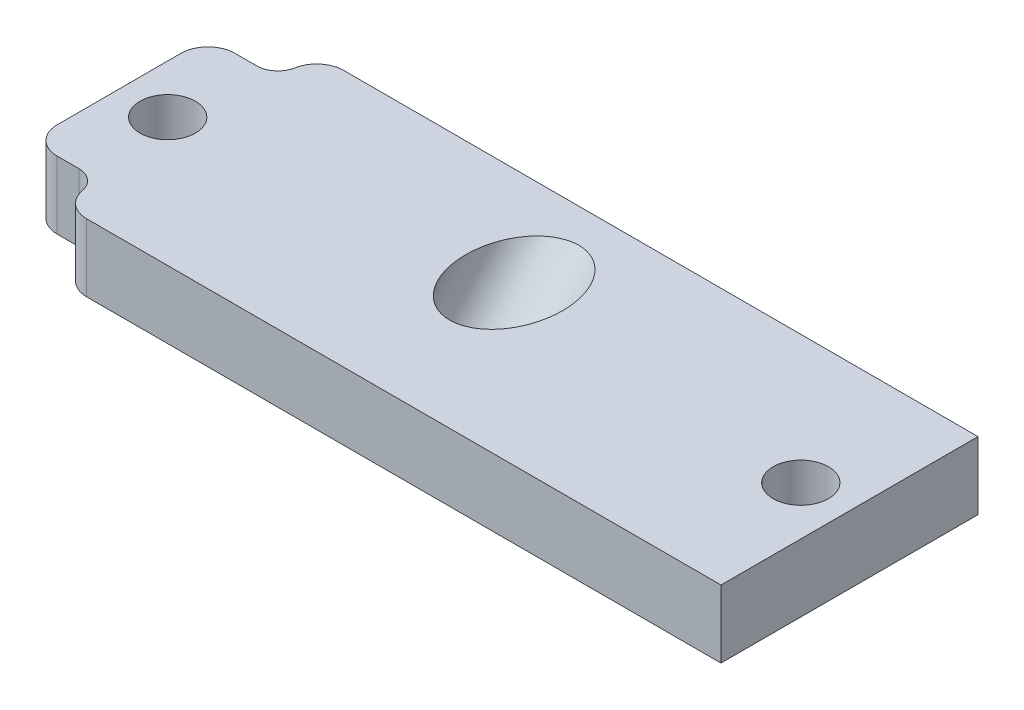
ISO-10303-21;
HEADER;
FILE_DESCRIPTION(('STEP AP214'),'2;1');
FILE_NAME('part.step','',(''),(''),'','','');
FILE_SCHEMA(('AUTOMOTIVE_DESIGN { 1 0 10303 214 1 1 1 1 }'));
ENDSEC;
DATA;
#1=APPLICATION_CONTEXT('core data for automotive mechanical design processes');
#2=APPLICATION_PROTOCOL_DEFINITION('international standard','automotive_design',2000,#1);
#3=PRODUCT_CONTEXT('',#1,'mechanical');
#4=PRODUCT('Part','Part','',(#3));
#5=PRODUCT_RELATED_PRODUCT_CATEGORY('part','',(#4));
#6=PRODUCT_DEFINITION_FORMATION('','',#4);
#7=PRODUCT_DEFINITION_CONTEXT('part definition',#1,'design');
#8=PRODUCT_DEFINITION('design','',#6,#7);
#9=PRODUCT_DEFINITION_SHAPE('','',#8);
#10=(LENGTH_UNIT() NAMED_UNIT(*) SI_UNIT(.MILLI.,.METRE.));
#11=(NAMED_UNIT(*) PLANE_ANGLE_UNIT() SI_UNIT($,.RADIAN.));
#12=(NAMED_UNIT(*) SI_UNIT($,.STERADIAN.) SOLID_ANGLE_UNIT());
#13=UNCERTAINTY_MEASURE_WITH_UNIT(LENGTH_MEASURE(1.E-05),#10,'distance_accuracy_value','');
#14=(GEOMETRIC_REPRESENTATION_CONTEXT(3) GLOBAL_UNCERTAINTY_ASSIGNED_CONTEXT((#13)) GLOBAL_UNIT_ASSIGNED_CONTEXT((#10,
#11,#12)) REPRESENTATION_CONTEXT('',''));
#15=CARTESIAN_POINT('',(0.,0.,0.));
#16=DIRECTION('',(0.,0.,1.));
#17=DIRECTION('',(1.,0.,0.));
#18=AXIS2_PLACEMENT_3D('',#15,#16,#17);
#19=CARTESIAN_POINT('',(0.,6.35,0.));
#20=DIRECTION('',(0.,-1.,0.));
#21=DIRECTION('',(0.,0.,-1.));
#22=AXIS2_PLACEMENT_3D('',#19,#20,#21);
#23=PLANE('',#22);
#24=CARTESIAN_POINT('',(34.29,6.35,-14.8740027149651));
#25=DIRECTION('',(0.,-1.,0.));
#26=DIRECTION('',(0.,0.,1.));
#27=AXIS2_PLACEMENT_3D('',#24,#25,#26);
#28=ELLIPSE('',#27,6.07512550302269,4.55);
#29=CARTESIAN_POINT('',(34.29,6.35,-8.79887721194244));
#30=VERTEX_POINT('',#29);
#31=EDGE_CURVE('E421',#30,#30,#28,.F.);
#32=ORIENTED_EDGE('',*,*,#31,.F.);
#33=EDGE_LOOP('',(#32));
#34=FACE_BOUND('',#33,.T.);
#35=CARTESIAN_POINT('',(4.57,6.35,-12.065));
#36=DIRECTION('',(0.,1.,0.));
#37=DIRECTION('',(0.,0.,1.));
#38=AXIS2_PLACEMENT_3D('',#35,#36,#37);
#39=CIRCLE('',#38,2.6);
#40=CARTESIAN_POINT('',(4.57,6.35,-9.465));
#41=VERTEX_POINT('',#40);
#42=EDGE_CURVE('E174',#41,#41,#39,.T.);
#43=ORIENTED_EDGE('',*,*,#42,.F.);
#44=EDGE_LOOP('',(#43));
#45=FACE_BOUND('',#44,.T.);
#46=CARTESIAN_POINT('',(64.01,6.35,-12.065));
#47=DIRECTION('',(0.,1.,0.));
#48=DIRECTION('',(0.,0.,1.));
#49=AXIS2_PLACEMENT_3D('',#46,#47,#48);
#50=CIRCLE('',#49,2.59999999999999);
#51=CARTESIAN_POINT('',(64.01,6.35,-9.46500000000001));
#52=VERTEX_POINT('',#51);
#53=EDGE_CURVE('E168',#52,#52,#50,.T.);
#54=ORIENTED_EDGE('',*,*,#53,.F.);
#55=EDGE_LOOP('',(#54));
#56=FACE_BOUND('',#55,.T.);
#57=CARTESIAN_POINT('',(4.57,6.35,-1.715));
#58=DIRECTION('',(0.,1.,0.));
#59=DIRECTION('',(0.,0.,1.));
#60=AXIS2_PLACEMENT_3D('',#57,#58,#59);
#61=CIRCLE('',#60,2.);
#62=CARTESIAN_POINT('',(4.57,6.35,-3.715));
#63=VERTEX_POINT('',#62);
#64=CARTESIAN_POINT('',(6.53670134597141,6.35,-2.07843612334802));
#65=VERTEX_POINT('',#64);
#66=EDGE_CURVE('E137',#63,#65,#61,.F.);
#67=ORIENTED_EDGE('',*,*,#66,.T.);
#68=CARTESIAN_POINT('',(9.03441205535511,6.35,-2.54));
#69=DIRECTION('',(0.,-1.,0.));
#70=DIRECTION('',(0.,0.,-1.));
#71=AXIS2_PLACEMENT_3D('',#68,#69,#70);
#72=CIRCLE('',#71,2.54);
#73=CARTESIAN_POINT('',(9.03441205535511,6.35,0.));
#74=VERTEX_POINT('',#73);
#75=EDGE_CURVE('E213',#65,#74,#72,.F.);
#76=ORIENTED_EDGE('',*,*,#75,.T.);
#77=DIRECTION('',(1.,0.,0.));
#78=VECTOR('',#77,1.);
#79=CARTESIAN_POINT('',(0.,6.35,0.));
#80=LINE('',#79,#78);
#81=CARTESIAN_POINT('',(68.58,6.35,0.));
#82=VERTEX_POINT('',#81);
#83=EDGE_CURVE('E183',#74,#82,#80,.T.);
#84=ORIENTED_EDGE('',*,*,#83,.T.);
#85=DIRECTION('',(0.,0.,-1.));
#86=VECTOR('',#85,1.);
#87=CARTESIAN_POINT('',(68.58,6.35,0.));
#88=LINE('',#87,#86);
#89=CARTESIAN_POINT('',(68.58,6.35,-24.13));
#90=VERTEX_POINT('',#89);
#91=EDGE_CURVE('E186',#82,#90,#88,.T.);
#92=ORIENTED_EDGE('',*,*,#91,.T.);
#93=DIRECTION('',(-1.,0.,0.));
#94=VECTOR('',#93,1.);
#95=CARTESIAN_POINT('',(0.,6.35,-24.13));
#96=LINE('',#95,#94);
#97=CARTESIAN_POINT('',(9.03441205535511,6.35,-24.13));
#98=VERTEX_POINT('',#97);
#99=EDGE_CURVE('E188',#90,#98,#96,.T.);
#100=ORIENTED_EDGE('',*,*,#99,.T.);
#101=CARTESIAN_POINT('',(9.03441205535511,6.35,-21.59));
#102=DIRECTION('',(0.,-1.,0.));
#103=DIRECTION('',(0.,0.,-1.));
#104=AXIS2_PLACEMENT_3D('',#101,#102,#103);
#105=CIRCLE('',#104,2.54);
#106=CARTESIAN_POINT('',(6.53670134597141,6.35,-22.051563876652));
#107=VERTEX_POINT('',#106);
#108=EDGE_CURVE('E207',#98,#107,#105,.F.);
#109=ORIENTED_EDGE('',*,*,#108,.T.);
#110=CARTESIAN_POINT('',(4.57,6.35,-22.415));
#111=DIRECTION('',(0.,1.,0.));
#112=DIRECTION('',(0.,0.,1.));
#113=AXIS2_PLACEMENT_3D('',#110,#111,#112);
#114=CIRCLE('',#113,2.);
#115=CARTESIAN_POINT('',(4.57,6.35,-20.415));
#116=VERTEX_POINT('',#115);
#117=EDGE_CURVE('E148',#116,#107,#114,.T.);
#118=ORIENTED_EDGE('',*,*,#117,.F.);
#119=DIRECTION('',(-1.,0.,0.));
#120=VECTOR('',#119,1.);
#121=CARTESIAN_POINT('',(0.,6.35,-20.415));
#122=LINE('',#121,#120);
#123=CARTESIAN_POINT('',(2.54,6.35,-20.415));
#124=VERTEX_POINT('',#123);
#125=EDGE_CURVE('E133',#116,#124,#122,.T.);
#126=ORIENTED_EDGE('',*,*,#125,.T.);
#127=CARTESIAN_POINT('',(2.54,6.35,-17.875));
#128=DIRECTION('',(0.,-1.,0.));
#129=DIRECTION('',(0.,0.,-1.));
#130=AXIS2_PLACEMENT_3D('',#127,#128,#129);
#131=CIRCLE('',#130,2.54);
#132=CARTESIAN_POINT('',(0.,6.35,-17.875));
#133=VERTEX_POINT('',#132);
#134=EDGE_CURVE('E209',#124,#133,#131,.F.);
#135=ORIENTED_EDGE('',*,*,#134,.T.);
#136=DIRECTION('',(0.,0.,1.));
#137=VECTOR('',#136,1.);
#138=CARTESIAN_POINT('',(0.,6.35,0.));
#139=LINE('',#138,#137);
#140=CARTESIAN_POINT('',(0.,6.35,-6.255));
#141=VERTEX_POINT('',#140);
#142=EDGE_CURVE('E180',#133,#141,#139,.T.);
#143=ORIENTED_EDGE('',*,*,#142,.T.);
#144=CARTESIAN_POINT('',(2.54,6.35,-6.255));
#145=DIRECTION('',(0.,-1.,0.));
#146=DIRECTION('',(0.,0.,-1.));
#147=AXIS2_PLACEMENT_3D('',#144,#145,#146);
#148=CIRCLE('',#147,2.54);
#149=CARTESIAN_POINT('',(2.54,6.35,-3.715));
#150=VERTEX_POINT('',#149);
#151=EDGE_CURVE('E211',#141,#150,#148,.F.);
#152=ORIENTED_EDGE('',*,*,#151,.T.);
#153=DIRECTION('',(-1.,0.,0.));
#154=VECTOR('',#153,1.);
#155=CARTESIAN_POINT('',(0.,6.35,-3.715));
#156=LINE('',#155,#154);
#157=EDGE_CURVE('E160',#63,#150,#156,.T.);
#158=ORIENTED_EDGE('',*,*,#157,.F.);
#159=EDGE_LOOP('',(#67,#76,#84,#92,#100,#109,#118,#126,#135,#143,#152,#158));
#160=FACE_BOUND('',#159,.T.);
#161=ADVANCED_FACE('F33',(#34,#45,#56,#160),#23,.F.);
#162=CARTESIAN_POINT('',(0.,0.,0.));
#163=DIRECTION('',(0.,-1.,0.));
#164=DIRECTION('',(0.,0.,-1.));
#165=AXIS2_PLACEMENT_3D('',#162,#163,#164);
#166=PLANE('',#165);
#167=CARTESIAN_POINT('',(34.29,0.,-9.25599728503487));
#168=DIRECTION('',(0.,-1.,0.));
#169=DIRECTION('',(0.,0.,-1.));
#170=AXIS2_PLACEMENT_3D('',#167,#168,#169);
#171=ELLIPSE('',#170,6.07512550302269,4.55);
#172=CARTESIAN_POINT('',(34.29,0.,-15.3311227880576));
#173=VERTEX_POINT('',#172);
#174=EDGE_CURVE('E152',#173,#173,#171,.T.);
#175=ORIENTED_EDGE('',*,*,#174,.F.);
#176=EDGE_LOOP('',(#175));
#177=FACE_BOUND('',#176,.T.);
#178=CARTESIAN_POINT('',(4.57,0.,-12.065));
#179=DIRECTION('',(0.,1.,0.));
#180=DIRECTION('',(0.,0.,1.));
#181=AXIS2_PLACEMENT_3D('',#178,#179,#180);
#182=CIRCLE('',#181,2.6);
#183=CARTESIAN_POINT('',(4.57,0.,-9.465));
#184=VERTEX_POINT('',#183);
#185=EDGE_CURVE('E171',#184,#184,#182,.T.);
#186=ORIENTED_EDGE('',*,*,#185,.T.);
#187=EDGE_LOOP('',(#186));
#188=FACE_BOUND('',#187,.T.);
#189=CARTESIAN_POINT('',(64.01,0.,-12.065));
#190=DIRECTION('',(0.,1.,0.));
#191=DIRECTION('',(0.,0.,1.));
#192=AXIS2_PLACEMENT_3D('',#189,#190,#191);
#193=CIRCLE('',#192,2.59999999999999);
#194=CARTESIAN_POINT('',(64.01,0.,-9.46500000000001));
#195=VERTEX_POINT('',#194);
#196=EDGE_CURVE('E167',#195,#195,#193,.T.);
#197=ORIENTED_EDGE('',*,*,#196,.T.);
#198=EDGE_LOOP('',(#197));
#199=FACE_BOUND('',#198,.T.);
#200=DIRECTION('',(1.,0.,0.));
#201=VECTOR('',#200,1.);
#202=CARTESIAN_POINT('',(0.,0.,0.));
#203=LINE('',#202,#201);
#204=CARTESIAN_POINT('',(9.03441205535511,0.,0.));
#205=VERTEX_POINT('',#204);
#206=CARTESIAN_POINT('',(68.58,0.,0.));
#207=VERTEX_POINT('',#206);
#208=EDGE_CURVE('E194',#205,#207,#203,.T.);
#209=ORIENTED_EDGE('',*,*,#208,.F.);
#210=CARTESIAN_POINT('',(9.03441205535511,0.,-2.54));
#211=DIRECTION('',(0.,-1.,0.));
#212=DIRECTION('',(0.,0.,-1.));
#213=AXIS2_PLACEMENT_3D('',#210,#211,#212);
#214=CIRCLE('',#213,2.54);
#215=CARTESIAN_POINT('',(6.53670134597141,0.,-2.07843612334802));
#216=VERTEX_POINT('',#215);
#217=EDGE_CURVE('E221',#205,#216,#214,.T.);
#218=ORIENTED_EDGE('',*,*,#217,.T.);
#219=CARTESIAN_POINT('',(4.57,0.,-1.715));
#220=DIRECTION('',(0.,1.,0.));
#221=DIRECTION('',(0.,0.,1.));
#222=AXIS2_PLACEMENT_3D('',#219,#220,#221);
#223=CIRCLE('',#222,2.);
#224=CARTESIAN_POINT('',(4.57,0.,-3.715));
#225=VERTEX_POINT('',#224);
#226=EDGE_CURVE('E156',#225,#216,#223,.F.);
#227=ORIENTED_EDGE('',*,*,#226,.F.);
#228=DIRECTION('',(-1.,0.,0.));
#229=VECTOR('',#228,1.);
#230=CARTESIAN_POINT('',(0.,0.,-3.715));
#231=LINE('',#230,#229);
#232=CARTESIAN_POINT('',(2.54,0.,-3.715));
#233=VERTEX_POINT('',#232);
#234=EDGE_CURVE('E159',#225,#233,#231,.T.);
#235=ORIENTED_EDGE('',*,*,#234,.T.);
#236=CARTESIAN_POINT('',(2.54,0.,-6.255));
#237=DIRECTION('',(0.,-1.,0.));
#238=DIRECTION('',(0.,0.,-1.));
#239=AXIS2_PLACEMENT_3D('',#236,#237,#238);
#240=CIRCLE('',#239,2.54);
#241=CARTESIAN_POINT('',(0.,0.,-6.255));
#242=VERTEX_POINT('',#241);
#243=EDGE_CURVE('E219',#233,#242,#240,.T.);
#244=ORIENTED_EDGE('',*,*,#243,.T.);
#245=DIRECTION('',(0.,0.,1.));
#246=VECTOR('',#245,1.);
#247=CARTESIAN_POINT('',(0.,0.,0.));
#248=LINE('',#247,#246);
#249=CARTESIAN_POINT('',(0.,0.,-17.875));
#250=VERTEX_POINT('',#249);
#251=EDGE_CURVE('E177',#250,#242,#248,.T.);
#252=ORIENTED_EDGE('',*,*,#251,.F.);
#253=CARTESIAN_POINT('',(2.54,0.,-17.875));
#254=DIRECTION('',(0.,-1.,0.));
#255=DIRECTION('',(0.,0.,-1.));
#256=AXIS2_PLACEMENT_3D('',#253,#254,#255);
#257=CIRCLE('',#256,2.54);
#258=CARTESIAN_POINT('',(2.54,0.,-20.415));
#259=VERTEX_POINT('',#258);
#260=EDGE_CURVE('E147',#250,#259,#257,.T.);
#261=ORIENTED_EDGE('',*,*,#260,.T.);
#262=DIRECTION('',(-1.,0.,0.));
#263=VECTOR('',#262,1.);
#264=CARTESIAN_POINT('',(0.,0.,-20.415));
#265=LINE('',#264,#263);
#266=CARTESIAN_POINT('',(4.57,0.,-20.415));
#267=VERTEX_POINT('',#266);
#268=EDGE_CURVE('E130',#267,#259,#265,.T.);
#269=ORIENTED_EDGE('',*,*,#268,.F.);
#270=CARTESIAN_POINT('',(4.57,0.,-22.415));
#271=DIRECTION('',(0.,1.,0.));
#272=DIRECTION('',(0.,0.,1.));
#273=AXIS2_PLACEMENT_3D('',#270,#271,#272);
#274=CIRCLE('',#273,2.);
#275=CARTESIAN_POINT('',(6.53670134597141,0.,-22.051563876652));
#276=VERTEX_POINT('',#275);
#277=EDGE_CURVE('E138',#267,#276,#274,.T.);
#278=ORIENTED_EDGE('',*,*,#277,.T.);
#279=CARTESIAN_POINT('',(9.03441205535511,0.,-21.59));
#280=DIRECTION('',(0.,-1.,0.));
#281=DIRECTION('',(0.,0.,-1.));
#282=AXIS2_PLACEMENT_3D('',#279,#280,#281);
#283=CIRCLE('',#282,2.54);
#284=CARTESIAN_POINT('',(9.03441205535511,0.,-24.13));
#285=VERTEX_POINT('',#284);
#286=EDGE_CURVE('E56',#276,#285,#283,.T.);
#287=ORIENTED_EDGE('',*,*,#286,.T.);
#288=DIRECTION('',(-1.,0.,0.));
#289=VECTOR('',#288,1.);
#290=CARTESIAN_POINT('',(0.,0.,-24.13));
#291=LINE('',#290,#289);
#292=CARTESIAN_POINT('',(68.58,0.,-24.13));
#293=VERTEX_POINT('',#292);
#294=EDGE_CURVE('E184',#293,#285,#291,.T.);
#295=ORIENTED_EDGE('',*,*,#294,.F.);
#296=DIRECTION('',(0.,0.,-1.));
#297=VECTOR('',#296,1.);
#298=CARTESIAN_POINT('',(68.58,0.,0.));
#299=LINE('',#298,#297);
#300=EDGE_CURVE('E196',#207,#293,#299,.T.);
#301=ORIENTED_EDGE('',*,*,#300,.F.);
#302=EDGE_LOOP('',(#209,#218,#227,#235,#244,#252,#261,#269,#278,#287,#295,#301));
#303=FACE_BOUND('',#302,.T.);
#304=ADVANCED_FACE('F144',(#177,#188,#199,#303),#166,.T.);
#305=CARTESIAN_POINT('',(0.,6.35,0.));
#306=DIRECTION('',(1.,0.,0.));
#307=DIRECTION('',(0.,0.,-1.));
#308=AXIS2_PLACEMENT_3D('',#305,#306,#307);
#309=PLANE('',#308);
#310=ORIENTED_EDGE('',*,*,#251,.T.);
#311=DIRECTION('',(0.,1.,0.));
#312=VECTOR('',#311,1.);
#313=CARTESIAN_POINT('',(0.,6.35,-6.255));
#314=LINE('',#313,#312);
#315=EDGE_CURVE('E225',#242,#141,#314,.T.);
#316=ORIENTED_EDGE('',*,*,#315,.T.);
#317=ORIENTED_EDGE('',*,*,#142,.F.);
#318=DIRECTION('',(0.,1.,0.));
#319=VECTOR('',#318,1.);
#320=CARTESIAN_POINT('',(0.,0.,-17.875));
#321=LINE('',#320,#319);
#322=EDGE_CURVE('E223',#133,#250,#321,.F.);
#323=ORIENTED_EDGE('',*,*,#322,.T.);
#324=EDGE_LOOP('',(#310,#316,#317,#323));
#325=FACE_BOUND('',#324,.T.);
#326=ADVANCED_FACE('F261',(#325),#309,.F.);
#327=CARTESIAN_POINT('',(0.,6.35,0.));
#328=DIRECTION('',(0.,0.,-1.));
#329=DIRECTION('',(-1.,0.,0.));
#330=AXIS2_PLACEMENT_3D('',#327,#328,#329);
#331=PLANE('',#330);
#332=ORIENTED_EDGE('',*,*,#83,.F.);
#333=DIRECTION('',(0.,-1.,0.));
#334=VECTOR('',#333,1.);
#335=CARTESIAN_POINT('',(9.03441205535511,0.,0.));
#336=LINE('',#335,#334);
#337=EDGE_CURVE('E215',#74,#205,#336,.T.);
#338=ORIENTED_EDGE('',*,*,#337,.T.);
#339=ORIENTED_EDGE('',*,*,#208,.T.);
#340=DIRECTION('',(0.,-1.,0.));
#341=VECTOR('',#340,1.);
#342=CARTESIAN_POINT('',(68.58,6.35,0.));
#343=LINE('',#342,#341);
#344=EDGE_CURVE('E201',#82,#207,#343,.T.);
#345=ORIENTED_EDGE('',*,*,#344,.F.);
#346=EDGE_LOOP('',(#332,#338,#339,#345));
#347=FACE_BOUND('',#346,.T.);
#348=ADVANCED_FACE('F292',(#347),#331,.F.);
#349=CARTESIAN_POINT('',(68.58,6.35,0.));
#350=DIRECTION('',(-1.,0.,0.));
#351=DIRECTION('',(0.,0.,1.));
#352=AXIS2_PLACEMENT_3D('',#349,#350,#351);
#353=PLANE('',#352);
#354=ORIENTED_EDGE('',*,*,#300,.T.);
#355=DIRECTION('',(0.,-1.,0.));
#356=VECTOR('',#355,1.);
#357=CARTESIAN_POINT('',(68.58,6.35,-24.13));
#358=LINE('',#357,#356);
#359=EDGE_CURVE('E191',#90,#293,#358,.T.);
#360=ORIENTED_EDGE('',*,*,#359,.F.);
#361=ORIENTED_EDGE('',*,*,#91,.F.);
#362=ORIENTED_EDGE('',*,*,#344,.T.);
#363=EDGE_LOOP('',(#354,#360,#361,#362));
#364=FACE_BOUND('',#363,.T.);
#365=ADVANCED_FACE('F242',(#364),#353,.F.);
#366=CARTESIAN_POINT('',(0.,6.35,-24.13));
#367=DIRECTION('',(0.,0.,1.));
#368=DIRECTION('',(1.,0.,0.));
#369=AXIS2_PLACEMENT_3D('',#366,#367,#368);
#370=PLANE('',#369);
#371=ORIENTED_EDGE('',*,*,#294,.T.);
#372=DIRECTION('',(0.,1.,0.));
#373=VECTOR('',#372,1.);
#374=CARTESIAN_POINT('',(9.03441205535511,6.35,-24.13));
#375=LINE('',#374,#373);
#376=EDGE_CURVE('E41',#285,#98,#375,.T.);
#377=ORIENTED_EDGE('',*,*,#376,.T.);
#378=ORIENTED_EDGE('',*,*,#99,.F.);
#379=ORIENTED_EDGE('',*,*,#359,.T.);
#380=EDGE_LOOP('',(#371,#377,#378,#379));
#381=FACE_BOUND('',#380,.T.);
#382=ADVANCED_FACE('F234',(#381),#370,.F.);
#383=CARTESIAN_POINT('',(4.57,6.35,-12.065));
#384=DIRECTION('',(0.,-1.,0.));
#385=DIRECTION('',(0.,0.,-1.));
#386=AXIS2_PLACEMENT_3D('',#383,#384,#385);
#387=CYLINDRICAL_SURFACE('',#386,2.6);
#388=ORIENTED_EDGE('',*,*,#42,.T.);
#389=EDGE_LOOP('',(#388));
#390=FACE_BOUND('',#389,.T.);
#391=ORIENTED_EDGE('',*,*,#185,.F.);
#392=EDGE_LOOP('',(#391));
#393=FACE_BOUND('',#392,.T.);
#394=ADVANCED_FACE('F285',(#390,#393),#387,.F.);
#395=CARTESIAN_POINT('',(64.01,6.35,-12.065));
#396=DIRECTION('',(0.,-1.,0.));
#397=DIRECTION('',(0.,0.,-1.));
#398=AXIS2_PLACEMENT_3D('',#395,#396,#397);
#399=CYLINDRICAL_SURFACE('',#398,2.59999999999999);
#400=ORIENTED_EDGE('',*,*,#53,.T.);
#401=EDGE_LOOP('',(#400));
#402=FACE_BOUND('',#401,.T.);
#403=ORIENTED_EDGE('',*,*,#196,.F.);
#404=EDGE_LOOP('',(#403));
#405=FACE_BOUND('',#404,.T.);
#406=ADVANCED_FACE('F356',(#402,#405),#399,.F.);
#407=CARTESIAN_POINT('',(4.57,0.,-1.715));
#408=DIRECTION('',(0.,1.,0.));
#409=DIRECTION('',(0.,0.,1.));
#410=AXIS2_PLACEMENT_3D('',#407,#408,#409);
#411=CYLINDRICAL_SURFACE('',#410,2.);
#412=ORIENTED_EDGE('',*,*,#226,.T.);
#413=DIRECTION('',(0.,1.,0.));
#414=VECTOR('',#413,1.);
#415=CARTESIAN_POINT('',(6.53670134597141,0.,-2.07843612334802));
#416=LINE('',#415,#414);
#417=EDGE_CURVE('E204',#216,#65,#416,.T.);
#418=ORIENTED_EDGE('',*,*,#417,.T.);
#419=ORIENTED_EDGE('',*,*,#66,.F.);
#420=DIRECTION('',(0.,1.,0.));
#421=VECTOR('',#420,1.);
#422=CARTESIAN_POINT('',(4.57,0.,-3.715));
#423=LINE('',#422,#421);
#424=EDGE_CURVE('E162',#225,#63,#423,.T.);
#425=ORIENTED_EDGE('',*,*,#424,.F.);
#426=EDGE_LOOP('',(#412,#418,#419,#425));
#427=FACE_BOUND('',#426,.T.);
#428=ADVANCED_FACE('F253',(#427),#411,.F.);
#429=CARTESIAN_POINT('',(0.,0.,-3.715));
#430=DIRECTION('',(0.,0.,-1.));
#431=DIRECTION('',(-1.,0.,0.));
#432=AXIS2_PLACEMENT_3D('',#429,#430,#431);
#433=PLANE('',#432);
#434=ORIENTED_EDGE('',*,*,#157,.T.);
#435=DIRECTION('',(0.,1.,0.));
#436=VECTOR('',#435,1.);
#437=CARTESIAN_POINT('',(2.54,0.,-3.715));
#438=LINE('',#437,#436);
#439=EDGE_CURVE('E48',#150,#233,#438,.F.);
#440=ORIENTED_EDGE('',*,*,#439,.T.);
#441=ORIENTED_EDGE('',*,*,#234,.F.);
#442=ORIENTED_EDGE('',*,*,#424,.T.);
#443=EDGE_LOOP('',(#434,#440,#441,#442));
#444=FACE_BOUND('',#443,.T.);
#445=ADVANCED_FACE('F255',(#444),#433,.F.);
#446=CARTESIAN_POINT('',(0.,0.,-20.415));
#447=DIRECTION('',(0.,0.,-1.));
#448=DIRECTION('',(-1.,0.,0.));
#449=AXIS2_PLACEMENT_3D('',#446,#447,#448);
#450=PLANE('',#449);
#451=ORIENTED_EDGE('',*,*,#268,.T.);
#452=DIRECTION('',(0.,1.,0.));
#453=VECTOR('',#452,1.);
#454=CARTESIAN_POINT('',(2.54,6.35,-20.415));
#455=LINE('',#454,#453);
#456=EDGE_CURVE('E229',#259,#124,#455,.T.);
#457=ORIENTED_EDGE('',*,*,#456,.T.);
#458=ORIENTED_EDGE('',*,*,#125,.F.);
#459=DIRECTION('',(0.,1.,0.));
#460=VECTOR('',#459,1.);
#461=CARTESIAN_POINT('',(4.57,0.,-20.415));
#462=LINE('',#461,#460);
#463=EDGE_CURVE('E125',#267,#116,#462,.T.);
#464=ORIENTED_EDGE('',*,*,#463,.F.);
#465=EDGE_LOOP('',(#451,#457,#458,#464));
#466=FACE_BOUND('',#465,.T.);
#467=ADVANCED_FACE('F127',(#466),#450,.T.);
#468=CARTESIAN_POINT('',(4.57,0.,-22.415));
#469=DIRECTION('',(0.,1.,0.));
#470=DIRECTION('',(0.,0.,1.));
#471=AXIS2_PLACEMENT_3D('',#468,#469,#470);
#472=CYLINDRICAL_SURFACE('',#471,2.);
#473=ORIENTED_EDGE('',*,*,#117,.T.);
#474=DIRECTION('',(0.,1.,0.));
#475=VECTOR('',#474,1.);
#476=CARTESIAN_POINT('',(6.53670134597141,0.,-22.051563876652));
#477=LINE('',#476,#475);
#478=EDGE_CURVE('E11',#107,#276,#477,.F.);
#479=ORIENTED_EDGE('',*,*,#478,.T.);
#480=ORIENTED_EDGE('',*,*,#277,.F.);
#481=ORIENTED_EDGE('',*,*,#463,.T.);
#482=EDGE_LOOP('',(#473,#479,#480,#481));
#483=FACE_BOUND('',#482,.T.);
#484=ADVANCED_FACE('F140',(#483),#472,.F.);
#485=CARTESIAN_POINT('',(9.03441205535511,0.,-2.54));
#486=DIRECTION('',(0.,1.,0.));
#487=DIRECTION('',(0.,0.,1.));
#488=AXIS2_PLACEMENT_3D('',#485,#486,#487);
#489=CYLINDRICAL_SURFACE('',#488,2.54);
#490=ORIENTED_EDGE('',*,*,#217,.F.);
#491=ORIENTED_EDGE('',*,*,#337,.F.);
#492=ORIENTED_EDGE('',*,*,#75,.F.);
#493=ORIENTED_EDGE('',*,*,#417,.F.);
#494=EDGE_LOOP('',(#490,#491,#492,#493));
#495=FACE_BOUND('',#494,.T.);
#496=ADVANCED_FACE('F250',(#495),#489,.T.);
#497=CARTESIAN_POINT('',(2.54,6.35,-6.255));
#498=DIRECTION('',(0.,1.,0.));
#499=DIRECTION('',(0.,0.,1.));
#500=AXIS2_PLACEMENT_3D('',#497,#498,#499);
#501=CYLINDRICAL_SURFACE('',#500,2.54);
#502=ORIENTED_EDGE('',*,*,#243,.F.);
#503=ORIENTED_EDGE('',*,*,#439,.F.);
#504=ORIENTED_EDGE('',*,*,#151,.F.);
#505=ORIENTED_EDGE('',*,*,#315,.F.);
#506=EDGE_LOOP('',(#502,#503,#504,#505));
#507=FACE_BOUND('',#506,.T.);
#508=ADVANCED_FACE('F258',(#507),#501,.T.);
#509=CARTESIAN_POINT('',(2.54,0.,-17.875));
#510=DIRECTION('',(0.,-1.,0.));
#511=DIRECTION('',(0.,0.,-1.));
#512=AXIS2_PLACEMENT_3D('',#509,#510,#511);
#513=CYLINDRICAL_SURFACE('',#512,2.54);
#514=ORIENTED_EDGE('',*,*,#260,.F.);
#515=ORIENTED_EDGE('',*,*,#322,.F.);
#516=ORIENTED_EDGE('',*,*,#134,.F.);
#517=ORIENTED_EDGE('',*,*,#456,.F.);
#518=EDGE_LOOP('',(#514,#515,#516,#517));
#519=FACE_BOUND('',#518,.T.);
#520=ADVANCED_FACE('F265',(#519),#513,.T.);
#521=CARTESIAN_POINT('',(9.03441205535511,0.,-21.59));
#522=DIRECTION('',(0.,1.,0.));
#523=DIRECTION('',(0.,0.,1.));
#524=AXIS2_PLACEMENT_3D('',#521,#522,#523);
#525=CYLINDRICAL_SURFACE('',#524,2.54);
#526=ORIENTED_EDGE('',*,*,#286,.F.);
#527=ORIENTED_EDGE('',*,*,#478,.F.);
#528=ORIENTED_EDGE('',*,*,#108,.F.);
#529=ORIENTED_EDGE('',*,*,#376,.F.);
#530=EDGE_LOOP('',(#526,#527,#528,#529));
#531=FACE_BOUND('',#530,.T.);
#532=ADVANCED_FACE('F35',(#531),#525,.T.);
#533=CARTESIAN_POINT('',(34.29,-4.59455945017947,-5.19107445995682));
#534=DIRECTION('',(0.,0.748955720789001,-0.662620048215738));
#535=DIRECTION('',(0.,0.662620048215739,0.748955720789001));
#536=AXIS2_PLACEMENT_3D('',#533,#534,#535);
#537=CYLINDRICAL_SURFACE('',#536,4.55);
#538=ORIENTED_EDGE('',*,*,#174,.T.);
#539=EDGE_LOOP('',(#538));
#540=FACE_BOUND('',#539,.T.);
#541=ORIENTED_EDGE('',*,*,#31,.T.);
#542=EDGE_LOOP('',(#541));
#543=FACE_BOUND('',#542,.T.);
#544=ADVANCED_FACE('F267',(#540,#543),#537,.F.);
#545=CLOSED_SHELL('',(#161,#304,#326,#348,#365,#382,#394,#406,#428,#445,#467,#484,#496,#508,
#520,#532,#544));
#546=MANIFOLD_SOLID_BREP('B2',#545);
#547=ADVANCED_BREP_SHAPE_REPRESENTATION('',(#18,#546),#14);
#548=SHAPE_DEFINITION_REPRESENTATION(#9,#547);
ENDSEC;
END-ISO-10303-21;
